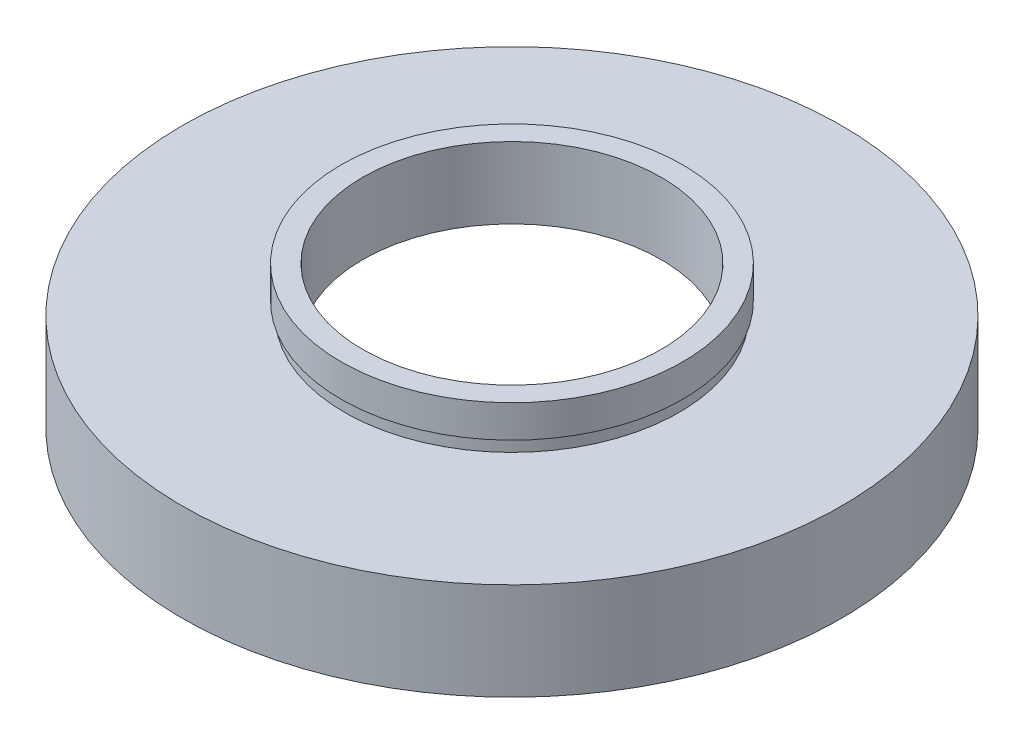
ISO-10303-21;
HEADER;
FILE_DESCRIPTION(('STEP AP214'),'2;1');
FILE_NAME('part.step','',(''),(''),'','','');
FILE_SCHEMA(('AUTOMOTIVE_DESIGN { 1 0 10303 214 1 1 1 1 }'));
ENDSEC;
DATA;
#1=APPLICATION_CONTEXT('core data for automotive mechanical design processes');
#2=APPLICATION_PROTOCOL_DEFINITION('international standard','automotive_design',2000,#1);
#3=PRODUCT_CONTEXT('',#1,'mechanical');
#4=PRODUCT('Part','Part','',(#3));
#5=PRODUCT_RELATED_PRODUCT_CATEGORY('part','',(#4));
#6=PRODUCT_DEFINITION_FORMATION('','',#4);
#7=PRODUCT_DEFINITION_CONTEXT('part definition',#1,'design');
#8=PRODUCT_DEFINITION('design','',#6,#7);
#9=PRODUCT_DEFINITION_SHAPE('','',#8);
#10=(LENGTH_UNIT() NAMED_UNIT(*) SI_UNIT(.MILLI.,.METRE.));
#11=(NAMED_UNIT(*) PLANE_ANGLE_UNIT() SI_UNIT($,.RADIAN.));
#12=(NAMED_UNIT(*) SI_UNIT($,.STERADIAN.) SOLID_ANGLE_UNIT());
#13=UNCERTAINTY_MEASURE_WITH_UNIT(LENGTH_MEASURE(1.E-05),#10,'distance_accuracy_value','');
#14=(GEOMETRIC_REPRESENTATION_CONTEXT(3) GLOBAL_UNCERTAINTY_ASSIGNED_CONTEXT((#13)) GLOBAL_UNIT_ASSIGNED_CONTEXT((#10,
#11,#12)) REPRESENTATION_CONTEXT('',''));
#15=CARTESIAN_POINT('',(0.,0.,0.));
#16=DIRECTION('',(0.,0.,1.));
#17=DIRECTION('',(1.,0.,0.));
#18=AXIS2_PLACEMENT_3D('',#15,#16,#17);
#19=CARTESIAN_POINT('',(25.4,0.,0.));
#20=DIRECTION('',(0.,1.,0.));
#21=DIRECTION('',(-1.,0.,0.));
#22=AXIS2_PLACEMENT_3D('',#19,#20,#21);
#23=PLANE('',#22);
#24=CARTESIAN_POINT('',(0.,0.,0.));
#25=DIRECTION('',(0.,1.,0.));
#26=DIRECTION('',(-1.,0.,0.));
#27=AXIS2_PLACEMENT_3D('',#24,#25,#26);
#28=CIRCLE('',#27,25.4);
#29=CARTESIAN_POINT('',(-25.4,0.,0.));
#30=VERTEX_POINT('',#29);
#31=EDGE_CURVE('E77',#30,#30,#28,.T.);
#32=ORIENTED_EDGE('',*,*,#31,.F.);
#33=EDGE_LOOP('',(#32));
#34=FACE_BOUND('',#33,.T.);
#35=CARTESIAN_POINT('',(0.,0.,0.));
#36=DIRECTION('',(0.,1.,0.));
#37=DIRECTION('',(-1.,0.,0.));
#38=AXIS2_PLACEMENT_3D('',#35,#36,#37);
#39=CIRCLE('',#38,23.);
#40=CARTESIAN_POINT('',(-23.,0.,0.));
#41=VERTEX_POINT('',#40);
#42=EDGE_CURVE('E10',#41,#41,#39,.T.);
#43=ORIENTED_EDGE('',*,*,#42,.T.);
#44=EDGE_LOOP('',(#43));
#45=FACE_BOUND('',#44,.T.);
#46=ADVANCED_FACE('F37',(#34,#45),#23,.F.);
#47=CARTESIAN_POINT('',(0.,16.8860182370821,0.));
#48=DIRECTION('',(0.,1.,0.));
#49=DIRECTION('',(-1.,0.,0.));
#50=AXIS2_PLACEMENT_3D('',#47,#48,#49);
#51=CYLINDRICAL_SURFACE('',#50,23.);
#52=ORIENTED_EDGE('',*,*,#42,.F.);
#53=EDGE_LOOP('',(#52));
#54=FACE_BOUND('',#53,.T.);
#55=CARTESIAN_POINT('',(0.,4.5,0.));
#56=DIRECTION('',(0.,1.,0.));
#57=DIRECTION('',(-1.,0.,0.));
#58=AXIS2_PLACEMENT_3D('',#55,#56,#57);
#59=CIRCLE('',#58,23.);
#60=CARTESIAN_POINT('',(-23.,4.49999999999999,0.));
#61=VERTEX_POINT('',#60);
#62=EDGE_CURVE('E43',#61,#61,#59,.T.);
#63=ORIENTED_EDGE('',*,*,#62,.T.);
#64=EDGE_LOOP('',(#63));
#65=FACE_BOUND('',#64,.T.);
#66=ADVANCED_FACE('F84',(#54,#65),#51,.F.);
#67=CARTESIAN_POINT('',(23.,4.5,0.));
#68=DIRECTION('',(0.,-1.,0.));
#69=DIRECTION('',(1.,0.,0.));
#70=AXIS2_PLACEMENT_3D('',#67,#68,#69);
#71=PLANE('',#70);
#72=ORIENTED_EDGE('',*,*,#62,.F.);
#73=EDGE_LOOP('',(#72));
#74=FACE_BOUND('',#73,.T.);
#75=CARTESIAN_POINT('',(0.,4.5,0.));
#76=DIRECTION('',(0.,1.,0.));
#77=DIRECTION('',(-1.,0.,0.));
#78=AXIS2_PLACEMENT_3D('',#75,#76,#77);
#79=CIRCLE('',#78,24.1);
#80=CARTESIAN_POINT('',(-24.1,4.49999999999999,0.));
#81=VERTEX_POINT('',#80);
#82=EDGE_CURVE('E47',#81,#81,#79,.T.);
#83=ORIENTED_EDGE('',*,*,#82,.T.);
#84=EDGE_LOOP('',(#83));
#85=FACE_BOUND('',#84,.T.);
#86=ADVANCED_FACE('F88',(#74,#85),#71,.F.);
#87=CARTESIAN_POINT('',(0.,16.8860182370821,0.));
#88=DIRECTION('',(0.,1.,0.));
#89=DIRECTION('',(-1.,0.,0.));
#90=AXIS2_PLACEMENT_3D('',#87,#88,#89);
#91=CYLINDRICAL_SURFACE('',#90,24.1);
#92=ORIENTED_EDGE('',*,*,#82,.F.);
#93=EDGE_LOOP('',(#92));
#94=FACE_BOUND('',#93,.T.);
#95=CARTESIAN_POINT('',(0.,5.5,0.));
#96=DIRECTION('',(0.,1.,0.));
#97=DIRECTION('',(-1.,0.,0.));
#98=AXIS2_PLACEMENT_3D('',#95,#96,#97);
#99=CIRCLE('',#98,24.1);
#100=CARTESIAN_POINT('',(-24.1,5.49999999999999,0.));
#101=VERTEX_POINT('',#100);
#102=EDGE_CURVE('E51',#101,#101,#99,.T.);
#103=ORIENTED_EDGE('',*,*,#102,.T.);
#104=EDGE_LOOP('',(#103));
#105=FACE_BOUND('',#104,.T.);
#106=ADVANCED_FACE('F93',(#94,#105),#91,.F.);
#107=CARTESIAN_POINT('',(11.5,5.5,0.));
#108=DIRECTION('',(0.,1.,0.));
#109=DIRECTION('',(-1.,0.,0.));
#110=AXIS2_PLACEMENT_3D('',#107,#108,#109);
#111=PLANE('',#110);
#112=ORIENTED_EDGE('',*,*,#102,.F.);
#113=EDGE_LOOP('',(#112));
#114=FACE_BOUND('',#113,.T.);
#115=CARTESIAN_POINT('',(0.,5.5,0.));
#116=DIRECTION('',(0.,1.,0.));
#117=DIRECTION('',(-1.,0.,0.));
#118=AXIS2_PLACEMENT_3D('',#115,#116,#117);
#119=CIRCLE('',#118,11.5);
#120=CARTESIAN_POINT('',(-11.5,5.5,0.));
#121=VERTEX_POINT('',#120);
#122=EDGE_CURVE('E56',#121,#121,#119,.T.);
#123=ORIENTED_EDGE('',*,*,#122,.T.);
#124=EDGE_LOOP('',(#123));
#125=FACE_BOUND('',#124,.T.);
#126=ADVANCED_FACE('F99',(#114,#125),#111,.F.);
#127=CARTESIAN_POINT('',(0.,16.8860182370821,0.));
#128=DIRECTION('',(0.,1.,0.));
#129=DIRECTION('',(-1.,0.,0.));
#130=AXIS2_PLACEMENT_3D('',#127,#128,#129);
#131=CYLINDRICAL_SURFACE('',#130,11.5);
#132=ORIENTED_EDGE('',*,*,#122,.F.);
#133=EDGE_LOOP('',(#132));
#134=FACE_BOUND('',#133,.T.);
#135=CARTESIAN_POINT('',(0.,11.,0.));
#136=DIRECTION('',(0.,1.,0.));
#137=DIRECTION('',(-1.,0.,0.));
#138=AXIS2_PLACEMENT_3D('',#135,#136,#137);
#139=CIRCLE('',#138,11.5);
#140=CARTESIAN_POINT('',(-11.5,11.,0.));
#141=VERTEX_POINT('',#140);
#142=EDGE_CURVE('E59',#141,#141,#139,.T.);
#143=ORIENTED_EDGE('',*,*,#142,.T.);
#144=EDGE_LOOP('',(#143));
#145=FACE_BOUND('',#144,.T.);
#146=ADVANCED_FACE('F103',(#134,#145),#131,.F.);
#147=CARTESIAN_POINT('',(11.5,11.,0.));
#148=DIRECTION('',(0.,-1.,0.));
#149=DIRECTION('',(1.,0.,0.));
#150=AXIS2_PLACEMENT_3D('',#147,#148,#149);
#151=PLANE('',#150);
#152=ORIENTED_EDGE('',*,*,#142,.F.);
#153=EDGE_LOOP('',(#152));
#154=FACE_BOUND('',#153,.T.);
#155=CARTESIAN_POINT('',(0.,11.,0.));
#156=DIRECTION('',(0.,1.,0.));
#157=DIRECTION('',(-1.,0.,0.));
#158=AXIS2_PLACEMENT_3D('',#155,#156,#157);
#159=CIRCLE('',#158,13.16);
#160=CARTESIAN_POINT('',(-13.16,11.,0.));
#161=VERTEX_POINT('',#160);
#162=EDGE_CURVE('E62',#161,#161,#159,.T.);
#163=ORIENTED_EDGE('',*,*,#162,.T.);
#164=EDGE_LOOP('',(#163));
#165=FACE_BOUND('',#164,.T.);
#166=ADVANCED_FACE('F107',(#154,#165),#151,.F.);
#167=CARTESIAN_POINT('',(0.,16.8860182370821,0.));
#168=DIRECTION('',(0.,1.,0.));
#169=DIRECTION('',(-1.,0.,0.));
#170=AXIS2_PLACEMENT_3D('',#167,#168,#169);
#171=CYLINDRICAL_SURFACE('',#170,13.16);
#172=ORIENTED_EDGE('',*,*,#162,.F.);
#173=EDGE_LOOP('',(#172));
#174=FACE_BOUND('',#173,.T.);
#175=CARTESIAN_POINT('',(0.,8.5,0.));
#176=DIRECTION('',(0.,1.,0.));
#177=DIRECTION('',(-1.,0.,0.));
#178=AXIS2_PLACEMENT_3D('',#175,#176,#177);
#179=CIRCLE('',#178,13.16);
#180=CARTESIAN_POINT('',(-13.16,8.5,0.));
#181=VERTEX_POINT('',#180);
#182=EDGE_CURVE('E65',#181,#181,#179,.T.);
#183=ORIENTED_EDGE('',*,*,#182,.T.);
#184=EDGE_LOOP('',(#183));
#185=FACE_BOUND('',#184,.T.);
#186=ADVANCED_FACE('F111',(#174,#185),#171,.T.);
#187=CARTESIAN_POINT('',(13.16,8.5,0.));
#188=DIRECTION('',(0.,1.,0.));
#189=DIRECTION('',(-1.,0.,0.));
#190=AXIS2_PLACEMENT_3D('',#187,#188,#189);
#191=PLANE('',#190);
#192=ORIENTED_EDGE('',*,*,#182,.F.);
#193=EDGE_LOOP('',(#192));
#194=FACE_BOUND('',#193,.T.);
#195=CARTESIAN_POINT('',(0.,8.5,0.));
#196=DIRECTION('',(0.,1.,0.));
#197=DIRECTION('',(-1.,0.,0.));
#198=AXIS2_PLACEMENT_3D('',#195,#196,#197);
#199=CIRCLE('',#198,12.9);
#200=CARTESIAN_POINT('',(-12.9,8.5,0.));
#201=VERTEX_POINT('',#200);
#202=EDGE_CURVE('E68',#201,#201,#199,.T.);
#203=ORIENTED_EDGE('',*,*,#202,.T.);
#204=EDGE_LOOP('',(#203));
#205=FACE_BOUND('',#204,.T.);
#206=ADVANCED_FACE('F115',(#194,#205),#191,.F.);
#207=CARTESIAN_POINT('',(0.,16.8860182370821,0.));
#208=DIRECTION('',(0.,1.,0.));
#209=DIRECTION('',(-1.,0.,0.));
#210=AXIS2_PLACEMENT_3D('',#207,#208,#209);
#211=CYLINDRICAL_SURFACE('',#210,12.9);
#212=ORIENTED_EDGE('',*,*,#202,.F.);
#213=EDGE_LOOP('',(#212));
#214=FACE_BOUND('',#213,.T.);
#215=CARTESIAN_POINT('',(0.,7.5,0.));
#216=DIRECTION('',(0.,1.,0.));
#217=DIRECTION('',(-1.,0.,0.));
#218=AXIS2_PLACEMENT_3D('',#215,#216,#217);
#219=CIRCLE('',#218,12.9);
#220=CARTESIAN_POINT('',(-12.9,7.5,0.));
#221=VERTEX_POINT('',#220);
#222=EDGE_CURVE('E71',#221,#221,#219,.T.);
#223=ORIENTED_EDGE('',*,*,#222,.T.);
#224=EDGE_LOOP('',(#223));
#225=FACE_BOUND('',#224,.T.);
#226=ADVANCED_FACE('F119',(#214,#225),#211,.T.);
#227=CARTESIAN_POINT('',(12.9,7.5,0.));
#228=DIRECTION('',(0.,-1.,0.));
#229=DIRECTION('',(1.,0.,0.));
#230=AXIS2_PLACEMENT_3D('',#227,#228,#229);
#231=PLANE('',#230);
#232=ORIENTED_EDGE('',*,*,#222,.F.);
#233=EDGE_LOOP('',(#232));
#234=FACE_BOUND('',#233,.T.);
#235=CARTESIAN_POINT('',(0.,7.5,0.));
#236=DIRECTION('',(0.,1.,0.));
#237=DIRECTION('',(-1.,0.,0.));
#238=AXIS2_PLACEMENT_3D('',#235,#236,#237);
#239=CIRCLE('',#238,25.4);
#240=CARTESIAN_POINT('',(-25.4,7.49999999999999,0.));
#241=VERTEX_POINT('',#240);
#242=EDGE_CURVE('E74',#241,#241,#239,.T.);
#243=ORIENTED_EDGE('',*,*,#242,.T.);
#244=EDGE_LOOP('',(#243));
#245=FACE_BOUND('',#244,.T.);
#246=ADVANCED_FACE('F123',(#234,#245),#231,.F.);
#247=CARTESIAN_POINT('',(0.,16.8860182370821,0.));
#248=DIRECTION('',(0.,1.,0.));
#249=DIRECTION('',(-1.,0.,0.));
#250=AXIS2_PLACEMENT_3D('',#247,#248,#249);
#251=CYLINDRICAL_SURFACE('',#250,25.4);
#252=ORIENTED_EDGE('',*,*,#242,.F.);
#253=EDGE_LOOP('',(#252));
#254=FACE_BOUND('',#253,.T.);
#255=ORIENTED_EDGE('',*,*,#31,.T.);
#256=EDGE_LOOP('',(#255));
#257=FACE_BOUND('',#256,.T.);
#258=ADVANCED_FACE('F81',(#254,#257),#251,.T.);
#259=CLOSED_SHELL('',(#46,#66,#86,#106,#126,#146,#166,#186,#206,#226,#246,#258));
#260=MANIFOLD_SOLID_BREP('B2',#259);
#261=ADVANCED_BREP_SHAPE_REPRESENTATION('',(#18,#260),#14);
#262=SHAPE_DEFINITION_REPRESENTATION(#9,#261);
ENDSEC;
END-ISO-10303-21;
